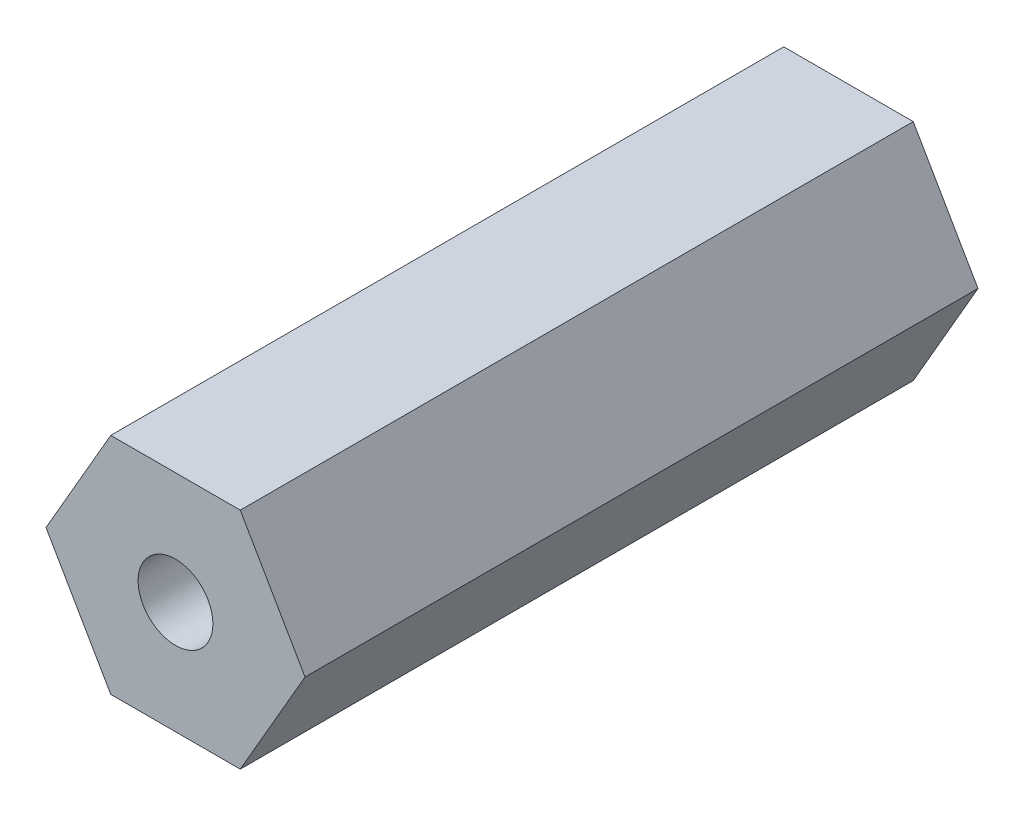
ISO-10303-21;
HEADER;
FILE_DESCRIPTION(('STEP AP214'),'2;1');
FILE_NAME('part.step','',(''),(''),'','','');
FILE_SCHEMA(('AUTOMOTIVE_DESIGN { 1 0 10303 214 1 1 1 1 }'));
ENDSEC;
DATA;
#1=APPLICATION_CONTEXT('core data for automotive mechanical design processes');
#2=APPLICATION_PROTOCOL_DEFINITION('international standard','automotive_design',2000,#1);
#3=PRODUCT_CONTEXT('',#1,'mechanical');
#4=PRODUCT('Part','Part','',(#3));
#5=PRODUCT_RELATED_PRODUCT_CATEGORY('part','',(#4));
#6=PRODUCT_DEFINITION_FORMATION('','',#4);
#7=PRODUCT_DEFINITION_CONTEXT('part definition',#1,'design');
#8=PRODUCT_DEFINITION('design','',#6,#7);
#9=PRODUCT_DEFINITION_SHAPE('','',#8);
#10=(LENGTH_UNIT() NAMED_UNIT(*) SI_UNIT(.MILLI.,.METRE.));
#11=(NAMED_UNIT(*) PLANE_ANGLE_UNIT() SI_UNIT($,.RADIAN.));
#12=(NAMED_UNIT(*) SI_UNIT($,.STERADIAN.) SOLID_ANGLE_UNIT());
#13=UNCERTAINTY_MEASURE_WITH_UNIT(LENGTH_MEASURE(1.E-05),#10,'distance_accuracy_value','');
#14=(GEOMETRIC_REPRESENTATION_CONTEXT(3) GLOBAL_UNCERTAINTY_ASSIGNED_CONTEXT((#13)) GLOBAL_UNIT_ASSIGNED_CONTEXT((#10,
#11,#12)) REPRESENTATION_CONTEXT('',''));
#15=CARTESIAN_POINT('',(0.,0.,0.));
#16=DIRECTION('',(0.,0.,1.));
#17=DIRECTION('',(1.,0.,0.));
#18=AXIS2_PLACEMENT_3D('',#15,#16,#17);
#19=CARTESIAN_POINT('',(0.,0.,18.));
#20=DIRECTION('',(0.,0.,1.));
#21=DIRECTION('',(1.,0.,0.));
#22=AXIS2_PLACEMENT_3D('',#19,#20,#21);
#23=PLANE('',#22);
#24=DIRECTION('',(0.499999999999995,0.866025403784442,0.));
#25=VECTOR('',#24,1.);
#26=CARTESIAN_POINT('',(1.73205080756891,-2.99999999999997,18.));
#27=LINE('',#26,#25);
#28=CARTESIAN_POINT('',(1.73205080756891,-2.99999999999997,18.));
#29=VERTEX_POINT('',#28);
#30=CARTESIAN_POINT('',(3.46410161513774,0.,18.));
#31=VERTEX_POINT('',#30);
#32=EDGE_CURVE('E129',#29,#31,#27,.T.);
#33=ORIENTED_EDGE('',*,*,#32,.T.);
#34=DIRECTION('',(-0.500000000000001,0.866025403784438,0.));
#35=VECTOR('',#34,1.);
#36=CARTESIAN_POINT('',(3.46410161513774,0.,18.));
#37=LINE('',#36,#35);
#38=CARTESIAN_POINT('',(1.73205080756886,2.99999999999999,18.));
#39=VERTEX_POINT('',#38);
#40=EDGE_CURVE('E87',#31,#39,#37,.T.);
#41=ORIENTED_EDGE('',*,*,#40,.T.);
#42=DIRECTION('',(-1.,0.,0.));
#43=VECTOR('',#42,1.);
#44=CARTESIAN_POINT('',(1.73205080756886,2.99999999999999,18.));
#45=LINE('',#44,#43);
#46=CARTESIAN_POINT('',(-1.73205080756888,2.99999999999998,18.));
#47=VERTEX_POINT('',#46);
#48=EDGE_CURVE('E100',#39,#47,#45,.T.);
#49=ORIENTED_EDGE('',*,*,#48,.T.);
#50=DIRECTION('',(-0.499999999999995,-0.866025403784441,0.));
#51=VECTOR('',#50,1.);
#52=CARTESIAN_POINT('',(-1.73205080756888,2.99999999999998,18.));
#53=LINE('',#52,#51);
#54=CARTESIAN_POINT('',(-3.46410161513774,0.,18.));
#55=VERTEX_POINT('',#54);
#56=EDGE_CURVE('E94',#47,#55,#53,.T.);
#57=ORIENTED_EDGE('',*,*,#56,.T.);
#58=DIRECTION('',(0.500000000000007,-0.866025403784434,0.));
#59=VECTOR('',#58,1.);
#60=CARTESIAN_POINT('',(-3.46410161513774,0.,18.));
#61=LINE('',#60,#59);
#62=CARTESIAN_POINT('',(-1.73205080756884,-3.,18.));
#63=VERTEX_POINT('',#62);
#64=EDGE_CURVE('E98',#55,#63,#61,.T.);
#65=ORIENTED_EDGE('',*,*,#64,.T.);
#66=DIRECTION('',(1.,0.,0.));
#67=VECTOR('',#66,1.);
#68=CARTESIAN_POINT('',(-1.73205080756884,-3.,18.));
#69=LINE('',#68,#67);
#70=EDGE_CURVE('E50',#63,#29,#69,.T.);
#71=ORIENTED_EDGE('',*,*,#70,.T.);
#72=EDGE_LOOP('',(#33,#41,#49,#57,#65,#71));
#73=FACE_BOUND('',#72,.T.);
#74=CARTESIAN_POINT('',(0.,0.,18.));
#75=DIRECTION('',(0.,0.,1.));
#76=DIRECTION('',(1.,0.,0.));
#77=AXIS2_PLACEMENT_3D('',#74,#75,#76);
#78=CIRCLE('',#77,1.);
#79=CARTESIAN_POINT('',(1.,0.,18.));
#80=VERTEX_POINT('',#79);
#81=EDGE_CURVE('E122',#80,#80,#78,.T.);
#82=ORIENTED_EDGE('',*,*,#81,.F.);
#83=EDGE_LOOP('',(#82));
#84=FACE_BOUND('',#83,.T.);
#85=ADVANCED_FACE('F33',(#73,#84),#23,.T.);
#86=CARTESIAN_POINT('',(0.,0.,0.));
#87=DIRECTION('',(0.,0.,1.));
#88=DIRECTION('',(1.,0.,0.));
#89=AXIS2_PLACEMENT_3D('',#86,#87,#88);
#90=PLANE('',#89);
#91=DIRECTION('',(0.499999999999995,0.866025403784442,0.));
#92=VECTOR('',#91,1.);
#93=CARTESIAN_POINT('',(1.73205080756891,-2.99999999999997,0.));
#94=LINE('',#93,#92);
#95=CARTESIAN_POINT('',(1.73205080756891,-2.99999999999997,0.));
#96=VERTEX_POINT('',#95);
#97=CARTESIAN_POINT('',(3.46410161513774,0.,0.));
#98=VERTEX_POINT('',#97);
#99=EDGE_CURVE('E118',#96,#98,#94,.T.);
#100=ORIENTED_EDGE('',*,*,#99,.F.);
#101=DIRECTION('',(1.,0.,0.));
#102=VECTOR('',#101,1.);
#103=CARTESIAN_POINT('',(-1.73205080756884,-3.,0.));
#104=LINE('',#103,#102);
#105=CARTESIAN_POINT('',(-1.73205080756884,-3.,0.));
#106=VERTEX_POINT('',#105);
#107=EDGE_CURVE('E79',#106,#96,#104,.T.);
#108=ORIENTED_EDGE('',*,*,#107,.F.);
#109=DIRECTION('',(0.500000000000007,-0.866025403784434,0.));
#110=VECTOR('',#109,1.);
#111=CARTESIAN_POINT('',(-3.46410161513774,0.,0.));
#112=LINE('',#111,#110);
#113=CARTESIAN_POINT('',(-3.46410161513774,0.,0.));
#114=VERTEX_POINT('',#113);
#115=EDGE_CURVE('E73',#114,#106,#112,.T.);
#116=ORIENTED_EDGE('',*,*,#115,.F.);
#117=DIRECTION('',(-0.499999999999995,-0.866025403784441,0.));
#118=VECTOR('',#117,1.);
#119=CARTESIAN_POINT('',(-1.73205080756888,2.99999999999998,0.));
#120=LINE('',#119,#118);
#121=CARTESIAN_POINT('',(-1.73205080756888,2.99999999999998,0.));
#122=VERTEX_POINT('',#121);
#123=EDGE_CURVE('E108',#122,#114,#120,.T.);
#124=ORIENTED_EDGE('',*,*,#123,.F.);
#125=DIRECTION('',(-1.,0.,0.));
#126=VECTOR('',#125,1.);
#127=CARTESIAN_POINT('',(1.73205080756886,2.99999999999999,0.));
#128=LINE('',#127,#126);
#129=CARTESIAN_POINT('',(1.73205080756886,2.99999999999999,0.));
#130=VERTEX_POINT('',#129);
#131=EDGE_CURVE('E124',#130,#122,#128,.T.);
#132=ORIENTED_EDGE('',*,*,#131,.F.);
#133=DIRECTION('',(-0.500000000000001,0.866025403784438,0.));
#134=VECTOR('',#133,1.);
#135=CARTESIAN_POINT('',(3.46410161513774,0.,0.));
#136=LINE('',#135,#134);
#137=EDGE_CURVE('E121',#98,#130,#136,.T.);
#138=ORIENTED_EDGE('',*,*,#137,.F.);
#139=EDGE_LOOP('',(#100,#108,#116,#124,#132,#138));
#140=FACE_BOUND('',#139,.T.);
#141=CARTESIAN_POINT('',(0.,0.,0.));
#142=DIRECTION('',(0.,0.,1.));
#143=DIRECTION('',(1.,0.,0.));
#144=AXIS2_PLACEMENT_3D('',#141,#142,#143);
#145=CIRCLE('',#144,1.);
#146=CARTESIAN_POINT('',(1.,0.,0.));
#147=VERTEX_POINT('',#146);
#148=EDGE_CURVE('E222',#147,#147,#145,.T.);
#149=ORIENTED_EDGE('',*,*,#148,.T.);
#150=EDGE_LOOP('',(#149));
#151=FACE_BOUND('',#150,.T.);
#152=ADVANCED_FACE('F138',(#140,#151),#90,.F.);
#153=CARTESIAN_POINT('',(1.73205080756891,-2.99999999999997,18.));
#154=DIRECTION('',(-0.866025403784442,0.499999999999995,0.));
#155=DIRECTION('',(-0.499999999999995,-0.866025403784442,0.));
#156=AXIS2_PLACEMENT_3D('',#153,#154,#155);
#157=PLANE('',#156);
#158=ORIENTED_EDGE('',*,*,#99,.T.);
#159=DIRECTION('',(0.,0.,-1.));
#160=VECTOR('',#159,1.);
#161=CARTESIAN_POINT('',(3.46410161513774,0.,18.));
#162=LINE('',#161,#160);
#163=EDGE_CURVE('E11',#31,#98,#162,.T.);
#164=ORIENTED_EDGE('',*,*,#163,.F.);
#165=ORIENTED_EDGE('',*,*,#32,.F.);
#166=DIRECTION('',(0.,0.,-1.));
#167=VECTOR('',#166,1.);
#168=CARTESIAN_POINT('',(1.73205080756891,-2.99999999999997,18.));
#169=LINE('',#168,#167);
#170=EDGE_CURVE('E114',#29,#96,#169,.T.);
#171=ORIENTED_EDGE('',*,*,#170,.T.);
#172=EDGE_LOOP('',(#158,#164,#165,#171));
#173=FACE_BOUND('',#172,.T.);
#174=ADVANCED_FACE('F35',(#173),#157,.F.);
#175=CARTESIAN_POINT('',(3.46410161513774,0.,18.));
#176=DIRECTION('',(-0.866025403784438,-0.500000000000001,0.));
#177=DIRECTION('',(0.500000000000001,-0.866025403784438,0.));
#178=AXIS2_PLACEMENT_3D('',#175,#176,#177);
#179=PLANE('',#178);
#180=ORIENTED_EDGE('',*,*,#137,.T.);
#181=DIRECTION('',(0.,0.,-1.));
#182=VECTOR('',#181,1.);
#183=CARTESIAN_POINT('',(1.73205080756886,2.99999999999999,18.));
#184=LINE('',#183,#182);
#185=EDGE_CURVE('E42',#39,#130,#184,.T.);
#186=ORIENTED_EDGE('',*,*,#185,.F.);
#187=ORIENTED_EDGE('',*,*,#40,.F.);
#188=ORIENTED_EDGE('',*,*,#163,.T.);
#189=EDGE_LOOP('',(#180,#186,#187,#188));
#190=FACE_BOUND('',#189,.T.);
#191=ADVANCED_FACE('F163',(#190),#179,.F.);
#192=CARTESIAN_POINT('',(1.73205080756886,2.99999999999999,18.));
#193=DIRECTION('',(0.,-1.,0.));
#194=DIRECTION('',(1.,0.,0.));
#195=AXIS2_PLACEMENT_3D('',#192,#193,#194);
#196=PLANE('',#195);
#197=ORIENTED_EDGE('',*,*,#131,.T.);
#198=DIRECTION('',(0.,0.,-1.));
#199=VECTOR('',#198,1.);
#200=CARTESIAN_POINT('',(-1.73205080756888,2.99999999999998,18.));
#201=LINE('',#200,#199);
#202=EDGE_CURVE('E109',#47,#122,#201,.T.);
#203=ORIENTED_EDGE('',*,*,#202,.F.);
#204=ORIENTED_EDGE('',*,*,#48,.F.);
#205=ORIENTED_EDGE('',*,*,#185,.T.);
#206=EDGE_LOOP('',(#197,#203,#204,#205));
#207=FACE_BOUND('',#206,.T.);
#208=ADVANCED_FACE('F135',(#207),#196,.F.);
#209=CARTESIAN_POINT('',(-1.73205080756888,2.99999999999998,18.));
#210=DIRECTION('',(0.866025403784442,-0.499999999999995,0.));
#211=DIRECTION('',(0.499999999999995,0.866025403784442,0.));
#212=AXIS2_PLACEMENT_3D('',#209,#210,#211);
#213=PLANE('',#212);
#214=ORIENTED_EDGE('',*,*,#123,.T.);
#215=DIRECTION('',(0.,0.,-1.));
#216=VECTOR('',#215,1.);
#217=CARTESIAN_POINT('',(-3.46410161513774,0.,18.));
#218=LINE('',#217,#216);
#219=EDGE_CURVE('E105',#55,#114,#218,.T.);
#220=ORIENTED_EDGE('',*,*,#219,.F.);
#221=ORIENTED_EDGE('',*,*,#56,.F.);
#222=ORIENTED_EDGE('',*,*,#202,.T.);
#223=EDGE_LOOP('',(#214,#220,#221,#222));
#224=FACE_BOUND('',#223,.T.);
#225=ADVANCED_FACE('F106',(#224),#213,.F.);
#226=CARTESIAN_POINT('',(-3.46410161513774,0.,18.));
#227=DIRECTION('',(0.866025403784434,0.500000000000007,0.));
#228=DIRECTION('',(-0.500000000000007,0.866025403784435,0.));
#229=AXIS2_PLACEMENT_3D('',#226,#227,#228);
#230=PLANE('',#229);
#231=ORIENTED_EDGE('',*,*,#115,.T.);
#232=DIRECTION('',(0.,0.,-1.));
#233=VECTOR('',#232,1.);
#234=CARTESIAN_POINT('',(-1.73205080756884,-3.,18.));
#235=LINE('',#234,#233);
#236=EDGE_CURVE('E110',#63,#106,#235,.T.);
#237=ORIENTED_EDGE('',*,*,#236,.F.);
#238=ORIENTED_EDGE('',*,*,#64,.F.);
#239=ORIENTED_EDGE('',*,*,#219,.T.);
#240=EDGE_LOOP('',(#231,#237,#238,#239));
#241=FACE_BOUND('',#240,.T.);
#242=ADVANCED_FACE('F112',(#241),#230,.F.);
#243=CARTESIAN_POINT('',(-1.73205080756884,-3.,18.));
#244=DIRECTION('',(0.,1.,0.));
#245=DIRECTION('',(-1.,0.,0.));
#246=AXIS2_PLACEMENT_3D('',#243,#244,#245);
#247=PLANE('',#246);
#248=ORIENTED_EDGE('',*,*,#107,.T.);
#249=ORIENTED_EDGE('',*,*,#170,.F.);
#250=ORIENTED_EDGE('',*,*,#70,.F.);
#251=ORIENTED_EDGE('',*,*,#236,.T.);
#252=EDGE_LOOP('',(#248,#249,#250,#251));
#253=FACE_BOUND('',#252,.T.);
#254=ADVANCED_FACE('F143',(#253),#247,.F.);
#255=CARTESIAN_POINT('',(0.,0.,18.));
#256=DIRECTION('',(0.,0.,-1.));
#257=DIRECTION('',(-1.,0.,0.));
#258=AXIS2_PLACEMENT_3D('',#255,#256,#257);
#259=CYLINDRICAL_SURFACE('',#258,1.);
#260=ORIENTED_EDGE('',*,*,#81,.T.);
#261=EDGE_LOOP('',(#260));
#262=FACE_BOUND('',#261,.T.);
#263=ORIENTED_EDGE('',*,*,#148,.F.);
#264=EDGE_LOOP('',(#263));
#265=FACE_BOUND('',#264,.T.);
#266=ADVANCED_FACE('F145',(#262,#265),#259,.F.);
#267=CLOSED_SHELL('',(#85,#152,#174,#191,#208,#225,#242,#254,#266));
#268=MANIFOLD_SOLID_BREP('B2',#267);
#269=ADVANCED_BREP_SHAPE_REPRESENTATION('',(#18,#268),#14);
#270=SHAPE_DEFINITION_REPRESENTATION(#9,#269);
ENDSEC;
END-ISO-10303-21;
